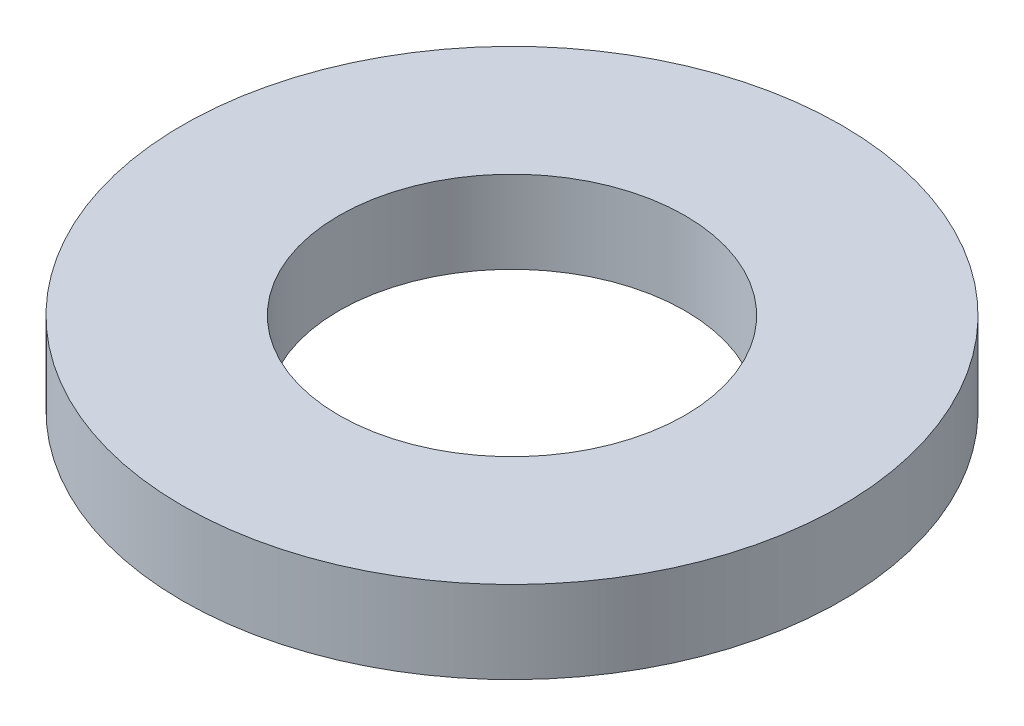
ISO-10303-21;
HEADER;
FILE_DESCRIPTION(('STEP AP214'),'2;1');
FILE_NAME('part.step','',(''),(''),'','','');
FILE_SCHEMA(('AUTOMOTIVE_DESIGN { 1 0 10303 214 1 1 1 1 }'));
ENDSEC;
DATA;
#1=APPLICATION_CONTEXT('core data for automotive mechanical design processes');
#2=APPLICATION_PROTOCOL_DEFINITION('international standard','automotive_design',2000,#1);
#3=PRODUCT_CONTEXT('',#1,'mechanical');
#4=PRODUCT('Part','Part','',(#3));
#5=PRODUCT_RELATED_PRODUCT_CATEGORY('part','',(#4));
#6=PRODUCT_DEFINITION_FORMATION('','',#4);
#7=PRODUCT_DEFINITION_CONTEXT('part definition',#1,'design');
#8=PRODUCT_DEFINITION('design','',#6,#7);
#9=PRODUCT_DEFINITION_SHAPE('','',#8);
#10=(LENGTH_UNIT() NAMED_UNIT(*) SI_UNIT(.MILLI.,.METRE.));
#11=(NAMED_UNIT(*) PLANE_ANGLE_UNIT() SI_UNIT($,.RADIAN.));
#12=(NAMED_UNIT(*) SI_UNIT($,.STERADIAN.) SOLID_ANGLE_UNIT());
#13=UNCERTAINTY_MEASURE_WITH_UNIT(LENGTH_MEASURE(1.E-05),#10,'distance_accuracy_value','');
#14=(GEOMETRIC_REPRESENTATION_CONTEXT(3) GLOBAL_UNCERTAINTY_ASSIGNED_CONTEXT((#13)) GLOBAL_UNIT_ASSIGNED_CONTEXT((#10,
#11,#12)) REPRESENTATION_CONTEXT('',''));
#15=CARTESIAN_POINT('',(0.,0.,0.));
#16=DIRECTION('',(0.,0.,1.));
#17=DIRECTION('',(1.,0.,0.));
#18=AXIS2_PLACEMENT_3D('',#15,#16,#17);
#19=CARTESIAN_POINT('',(0.,1.,0.));
#20=DIRECTION('',(0.,1.,0.));
#21=DIRECTION('',(0.,0.,1.));
#22=AXIS2_PLACEMENT_3D('',#19,#20,#21);
#23=PLANE('',#22);
#24=CARTESIAN_POINT('',(0.,1.,0.));
#25=DIRECTION('',(0.,-1.,0.));
#26=DIRECTION('',(0.,0.,-1.));
#27=AXIS2_PLACEMENT_3D('',#24,#25,#26);
#28=CIRCLE('',#27,4.);
#29=CARTESIAN_POINT('',(0.,1.,-4.));
#30=VERTEX_POINT('',#29);
#31=EDGE_CURVE('E27',#30,#30,#28,.T.);
#32=ORIENTED_EDGE('',*,*,#31,.F.);
#33=EDGE_LOOP('',(#32));
#34=FACE_BOUND('',#33,.T.);
#35=CARTESIAN_POINT('',(0.,1.,0.));
#36=DIRECTION('',(0.,-1.,0.));
#37=DIRECTION('',(0.,0.,-1.));
#38=AXIS2_PLACEMENT_3D('',#35,#36,#37);
#39=CIRCLE('',#38,2.1);
#40=CARTESIAN_POINT('',(0.,1.,-2.1));
#41=VERTEX_POINT('',#40);
#42=EDGE_CURVE('E18',#41,#41,#39,.T.);
#43=ORIENTED_EDGE('',*,*,#42,.T.);
#44=EDGE_LOOP('',(#43));
#45=FACE_BOUND('',#44,.T.);
#46=ADVANCED_FACE('F15',(#34,#45),#23,.T.);
#47=CARTESIAN_POINT('',(0.,1.,0.));
#48=DIRECTION('',(0.,-1.,0.));
#49=DIRECTION('',(0.,0.,-1.));
#50=AXIS2_PLACEMENT_3D('',#47,#48,#49);
#51=CYLINDRICAL_SURFACE('',#50,2.1);
#52=CARTESIAN_POINT('',(0.,0.,0.));
#53=DIRECTION('',(0.,-1.,0.));
#54=DIRECTION('',(0.,0.,-1.));
#55=AXIS2_PLACEMENT_3D('',#52,#53,#54);
#56=CIRCLE('',#55,2.1);
#57=CARTESIAN_POINT('',(0.,0.,-2.1));
#58=VERTEX_POINT('',#57);
#59=EDGE_CURVE('E22',#58,#58,#56,.T.);
#60=ORIENTED_EDGE('',*,*,#59,.T.);
#61=EDGE_LOOP('',(#60));
#62=FACE_BOUND('',#61,.T.);
#63=ORIENTED_EDGE('',*,*,#42,.F.);
#64=EDGE_LOOP('',(#63));
#65=FACE_BOUND('',#64,.T.);
#66=ADVANCED_FACE('F36',(#62,#65),#51,.F.);
#67=CARTESIAN_POINT('',(0.,1.,0.));
#68=DIRECTION('',(0.,-1.,0.));
#69=DIRECTION('',(0.,0.,-1.));
#70=AXIS2_PLACEMENT_3D('',#67,#68,#69);
#71=CYLINDRICAL_SURFACE('',#70,4.);
#72=ORIENTED_EDGE('',*,*,#31,.T.);
#73=EDGE_LOOP('',(#72));
#74=FACE_BOUND('',#73,.T.);
#75=CARTESIAN_POINT('',(0.,0.,0.));
#76=DIRECTION('',(0.,-1.,0.));
#77=DIRECTION('',(0.,0.,-1.));
#78=AXIS2_PLACEMENT_3D('',#75,#76,#77);
#79=CIRCLE('',#78,4.);
#80=CARTESIAN_POINT('',(0.,0.,-4.));
#81=VERTEX_POINT('',#80);
#82=EDGE_CURVE('E10',#81,#81,#79,.F.);
#83=ORIENTED_EDGE('',*,*,#82,.T.);
#84=EDGE_LOOP('',(#83));
#85=FACE_BOUND('',#84,.T.);
#86=ADVANCED_FACE('F38',(#74,#85),#71,.T.);
#87=CARTESIAN_POINT('',(0.,0.,0.));
#88=DIRECTION('',(0.,1.,0.));
#89=DIRECTION('',(0.,0.,1.));
#90=AXIS2_PLACEMENT_3D('',#87,#88,#89);
#91=PLANE('',#90);
#92=ORIENTED_EDGE('',*,*,#82,.F.);
#93=EDGE_LOOP('',(#92));
#94=FACE_BOUND('',#93,.T.);
#95=ORIENTED_EDGE('',*,*,#59,.F.);
#96=EDGE_LOOP('',(#95));
#97=FACE_BOUND('',#96,.T.);
#98=ADVANCED_FACE('F45',(#94,#97),#91,.F.);
#99=CLOSED_SHELL('',(#46,#66,#86,#98));
#100=MANIFOLD_SOLID_BREP('B1',#99);
#101=ADVANCED_BREP_SHAPE_REPRESENTATION('',(#18,#100),#14);
#102=SHAPE_DEFINITION_REPRESENTATION(#9,#101);
ENDSEC;
END-ISO-10303-21;
